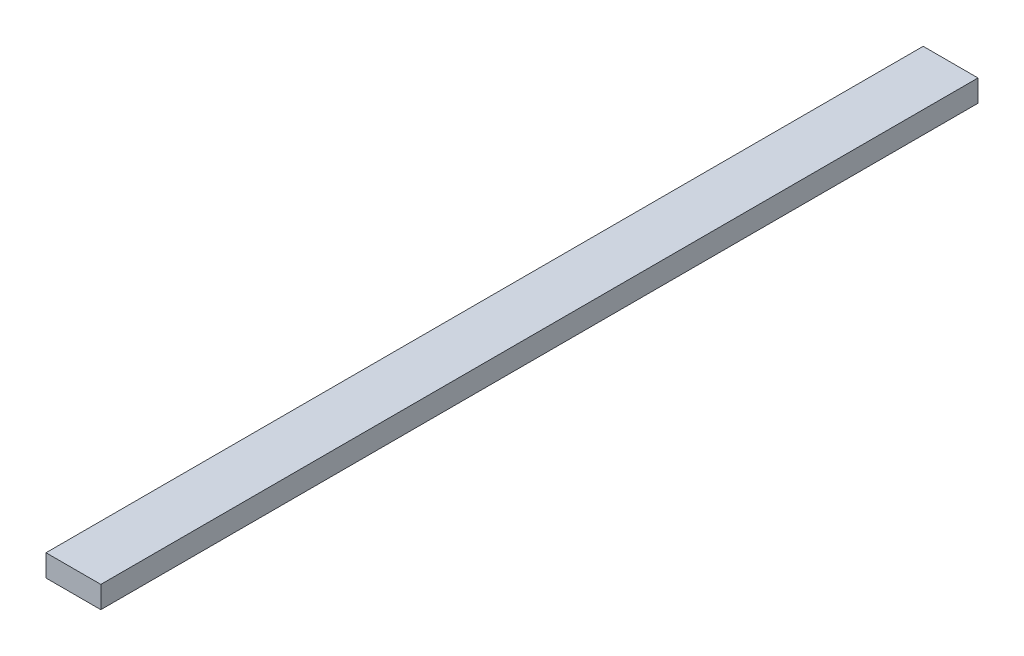
ISO-10303-21;
HEADER;
FILE_DESCRIPTION(('STEP AP214'),'2;1');
FILE_NAME('part.step','',(''),(''),'','','');
FILE_SCHEMA(('AUTOMOTIVE_DESIGN { 1 0 10303 214 1 1 1 1 }'));
ENDSEC;
DATA;
#1=APPLICATION_CONTEXT('core data for automotive mechanical design processes');
#2=APPLICATION_PROTOCOL_DEFINITION('international standard','automotive_design',2000,#1);
#3=PRODUCT_CONTEXT('',#1,'mechanical');
#4=PRODUCT('Part','Part','',(#3));
#5=PRODUCT_RELATED_PRODUCT_CATEGORY('part','',(#4));
#6=PRODUCT_DEFINITION_FORMATION('','',#4);
#7=PRODUCT_DEFINITION_CONTEXT('part definition',#1,'design');
#8=PRODUCT_DEFINITION('design','',#6,#7);
#9=PRODUCT_DEFINITION_SHAPE('','',#8);
#10=(LENGTH_UNIT() NAMED_UNIT(*) SI_UNIT(.MILLI.,.METRE.));
#11=(NAMED_UNIT(*) PLANE_ANGLE_UNIT() SI_UNIT($,.RADIAN.));
#12=(NAMED_UNIT(*) SI_UNIT($,.STERADIAN.) SOLID_ANGLE_UNIT());
#13=UNCERTAINTY_MEASURE_WITH_UNIT(LENGTH_MEASURE(1.E-05),#10,'distance_accuracy_value','');
#14=(GEOMETRIC_REPRESENTATION_CONTEXT(3) GLOBAL_UNCERTAINTY_ASSIGNED_CONTEXT((#13)) GLOBAL_UNIT_ASSIGNED_CONTEXT((#10,
#11,#12)) REPRESENTATION_CONTEXT('',''));
#15=CARTESIAN_POINT('',(0.,0.,0.));
#16=DIRECTION('',(0.,0.,1.));
#17=DIRECTION('',(1.,0.,0.));
#18=AXIS2_PLACEMENT_3D('',#15,#16,#17);
#19=CARTESIAN_POINT('',(0.,100.,0.));
#20=DIRECTION('',(1.,0.,0.));
#21=DIRECTION('',(0.,0.,-1.));
#22=AXIS2_PLACEMENT_3D('',#19,#20,#21);
#23=PLANE('',#22);
#24=DIRECTION('',(0.,0.,1.));
#25=VECTOR('',#24,1.);
#26=CARTESIAN_POINT('',(0.,0.,0.));
#27=LINE('',#26,#25);
#28=CARTESIAN_POINT('',(0.,0.,-4000.));
#29=VERTEX_POINT('',#28);
#30=CARTESIAN_POINT('',(0.,0.,0.));
#31=VERTEX_POINT('',#30);
#32=EDGE_CURVE('E100',#29,#31,#27,.T.);
#33=ORIENTED_EDGE('',*,*,#32,.T.);
#34=DIRECTION('',(0.,-1.,0.));
#35=VECTOR('',#34,1.);
#36=CARTESIAN_POINT('',(0.,100.,0.));
#37=LINE('',#36,#35);
#38=CARTESIAN_POINT('',(0.,100.,0.));
#39=VERTEX_POINT('',#38);
#40=EDGE_CURVE('E11',#39,#31,#37,.T.);
#41=ORIENTED_EDGE('',*,*,#40,.F.);
#42=DIRECTION('',(0.,0.,1.));
#43=VECTOR('',#42,1.);
#44=CARTESIAN_POINT('',(0.,100.,0.));
#45=LINE('',#44,#43);
#46=CARTESIAN_POINT('',(0.,100.,-4000.));
#47=VERTEX_POINT('',#46);
#48=EDGE_CURVE('E88',#47,#39,#45,.T.);
#49=ORIENTED_EDGE('',*,*,#48,.F.);
#50=DIRECTION('',(0.,-1.,0.));
#51=VECTOR('',#50,1.);
#52=CARTESIAN_POINT('',(0.,100.,-4000.));
#53=LINE('',#52,#51);
#54=EDGE_CURVE('E96',#47,#29,#53,.T.);
#55=ORIENTED_EDGE('',*,*,#54,.T.);
#56=EDGE_LOOP('',(#33,#41,#49,#55));
#57=FACE_BOUND('',#56,.T.);
#58=ADVANCED_FACE('F37',(#57),#23,.F.);
#59=CARTESIAN_POINT('',(0.,100.,0.));
#60=DIRECTION('',(0.,0.,-1.));
#61=DIRECTION('',(-1.,0.,0.));
#62=AXIS2_PLACEMENT_3D('',#59,#60,#61);
#63=PLANE('',#62);
#64=DIRECTION('',(1.,0.,0.));
#65=VECTOR('',#64,1.);
#66=CARTESIAN_POINT('',(0.,0.,0.));
#67=LINE('',#66,#65);
#68=CARTESIAN_POINT('',(250.,0.,0.));
#69=VERTEX_POINT('',#68);
#70=EDGE_CURVE('E92',#31,#69,#67,.T.);
#71=ORIENTED_EDGE('',*,*,#70,.T.);
#72=DIRECTION('',(0.,-1.,0.));
#73=VECTOR('',#72,1.);
#74=CARTESIAN_POINT('',(250.,100.,0.));
#75=LINE('',#74,#73);
#76=CARTESIAN_POINT('',(250.,100.,0.));
#77=VERTEX_POINT('',#76);
#78=EDGE_CURVE('E45',#77,#69,#75,.T.);
#79=ORIENTED_EDGE('',*,*,#78,.F.);
#80=DIRECTION('',(1.,0.,0.));
#81=VECTOR('',#80,1.);
#82=CARTESIAN_POINT('',(0.,100.,0.));
#83=LINE('',#82,#81);
#84=EDGE_CURVE('E83',#39,#77,#83,.T.);
#85=ORIENTED_EDGE('',*,*,#84,.F.);
#86=ORIENTED_EDGE('',*,*,#40,.T.);
#87=EDGE_LOOP('',(#71,#79,#85,#86));
#88=FACE_BOUND('',#87,.T.);
#89=ADVANCED_FACE('F91',(#88),#63,.F.);
#90=CARTESIAN_POINT('',(250.,100.,0.));
#91=DIRECTION('',(-1.,0.,0.));
#92=DIRECTION('',(0.,0.,1.));
#93=AXIS2_PLACEMENT_3D('',#90,#91,#92);
#94=PLANE('',#93);
#95=DIRECTION('',(0.,0.,-1.));
#96=VECTOR('',#95,1.);
#97=CARTESIAN_POINT('',(250.,0.,0.));
#98=LINE('',#97,#96);
#99=CARTESIAN_POINT('',(250.,0.,-4000.));
#100=VERTEX_POINT('',#99);
#101=EDGE_CURVE('E70',#69,#100,#98,.T.);
#102=ORIENTED_EDGE('',*,*,#101,.T.);
#103=DIRECTION('',(0.,-1.,0.));
#104=VECTOR('',#103,1.);
#105=CARTESIAN_POINT('',(250.,100.,-4000.));
#106=LINE('',#105,#104);
#107=CARTESIAN_POINT('',(250.,100.,-4000.));
#108=VERTEX_POINT('',#107);
#109=EDGE_CURVE('E93',#108,#100,#106,.T.);
#110=ORIENTED_EDGE('',*,*,#109,.F.);
#111=DIRECTION('',(0.,0.,-1.));
#112=VECTOR('',#111,1.);
#113=CARTESIAN_POINT('',(250.,100.,0.));
#114=LINE('',#113,#112);
#115=EDGE_CURVE('E86',#77,#108,#114,.T.);
#116=ORIENTED_EDGE('',*,*,#115,.F.);
#117=ORIENTED_EDGE('',*,*,#78,.T.);
#118=EDGE_LOOP('',(#102,#110,#116,#117));
#119=FACE_BOUND('',#118,.T.);
#120=ADVANCED_FACE('F94',(#119),#94,.F.);
#121=CARTESIAN_POINT('',(0.,100.,-4000.));
#122=DIRECTION('',(0.,0.,1.));
#123=DIRECTION('',(1.,0.,0.));
#124=AXIS2_PLACEMENT_3D('',#121,#122,#123);
#125=PLANE('',#124);
#126=DIRECTION('',(-1.,0.,0.));
#127=VECTOR('',#126,1.);
#128=CARTESIAN_POINT('',(0.,0.,-4000.));
#129=LINE('',#128,#127);
#130=EDGE_CURVE('E76',#100,#29,#129,.T.);
#131=ORIENTED_EDGE('',*,*,#130,.T.);
#132=ORIENTED_EDGE('',*,*,#54,.F.);
#133=DIRECTION('',(-1.,0.,0.));
#134=VECTOR('',#133,1.);
#135=CARTESIAN_POINT('',(0.,100.,-4000.));
#136=LINE('',#135,#134);
#137=EDGE_CURVE('E53',#108,#47,#136,.T.);
#138=ORIENTED_EDGE('',*,*,#137,.F.);
#139=ORIENTED_EDGE('',*,*,#109,.T.);
#140=EDGE_LOOP('',(#131,#132,#138,#139));
#141=FACE_BOUND('',#140,.T.);
#142=ADVANCED_FACE('F107',(#141),#125,.F.);
#143=CARTESIAN_POINT('',(0.,100.,0.));
#144=DIRECTION('',(0.,-1.,0.));
#145=DIRECTION('',(0.,0.,-1.));
#146=AXIS2_PLACEMENT_3D('',#143,#144,#145);
#147=PLANE('',#146);
#148=ORIENTED_EDGE('',*,*,#48,.T.);
#149=ORIENTED_EDGE('',*,*,#84,.T.);
#150=ORIENTED_EDGE('',*,*,#115,.T.);
#151=ORIENTED_EDGE('',*,*,#137,.T.);
#152=EDGE_LOOP('',(#148,#149,#150,#151));
#153=FACE_BOUND('',#152,.T.);
#154=ADVANCED_FACE('F84',(#153),#147,.F.);
#155=CARTESIAN_POINT('',(0.,0.,0.));
#156=DIRECTION('',(0.,-1.,0.));
#157=DIRECTION('',(0.,0.,-1.));
#158=AXIS2_PLACEMENT_3D('',#155,#156,#157);
#159=PLANE('',#158);
#160=ORIENTED_EDGE('',*,*,#32,.F.);
#161=ORIENTED_EDGE('',*,*,#130,.F.);
#162=ORIENTED_EDGE('',*,*,#101,.F.);
#163=ORIENTED_EDGE('',*,*,#70,.F.);
#164=EDGE_LOOP('',(#160,#161,#162,#163));
#165=FACE_BOUND('',#164,.T.);
#166=ADVANCED_FACE('F110',(#165),#159,.T.);
#167=CLOSED_SHELL('',(#58,#89,#120,#142,#154,#166));
#168=MANIFOLD_SOLID_BREP('B2',#167);
#169=ADVANCED_BREP_SHAPE_REPRESENTATION('',(#18,#168),#14);
#170=SHAPE_DEFINITION_REPRESENTATION(#9,#169);
ENDSEC;
END-ISO-10303-21;
